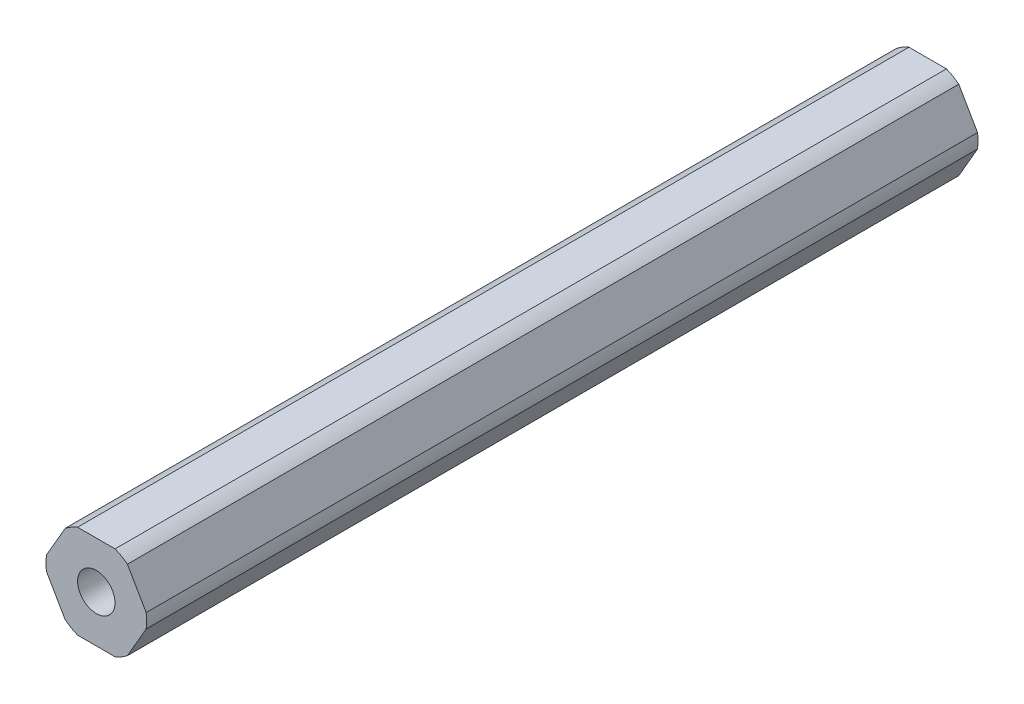
ISO-10303-21;
HEADER;
FILE_DESCRIPTION(('STEP AP214'),'2;1');
FILE_NAME('part.step','',(''),(''),'','','');
FILE_SCHEMA(('AUTOMOTIVE_DESIGN { 1 0 10303 214 1 1 1 1 }'));
ENDSEC;
DATA;
#1=APPLICATION_CONTEXT('core data for automotive mechanical design processes');
#2=APPLICATION_PROTOCOL_DEFINITION('international standard','automotive_design',2000,#1);
#3=PRODUCT_CONTEXT('',#1,'mechanical');
#4=PRODUCT('Part','Part','',(#3));
#5=PRODUCT_RELATED_PRODUCT_CATEGORY('part','',(#4));
#6=PRODUCT_DEFINITION_FORMATION('','',#4);
#7=PRODUCT_DEFINITION_CONTEXT('part definition',#1,'design');
#8=PRODUCT_DEFINITION('design','',#6,#7);
#9=PRODUCT_DEFINITION_SHAPE('','',#8);
#10=(LENGTH_UNIT() NAMED_UNIT(*) SI_UNIT(.MILLI.,.METRE.));
#11=(NAMED_UNIT(*) PLANE_ANGLE_UNIT() SI_UNIT($,.RADIAN.));
#12=(NAMED_UNIT(*) SI_UNIT($,.STERADIAN.) SOLID_ANGLE_UNIT());
#13=UNCERTAINTY_MEASURE_WITH_UNIT(LENGTH_MEASURE(1.E-05),#10,'distance_accuracy_value','');
#14=(GEOMETRIC_REPRESENTATION_CONTEXT(3) GLOBAL_UNCERTAINTY_ASSIGNED_CONTEXT((#13)) GLOBAL_UNIT_ASSIGNED_CONTEXT((#10,
#11,#12)) REPRESENTATION_CONTEXT('',''));
#15=CARTESIAN_POINT('',(0.,0.,0.));
#16=DIRECTION('',(0.,0.,1.));
#17=DIRECTION('',(1.,0.,0.));
#18=AXIS2_PLACEMENT_3D('',#15,#16,#17);
#19=CARTESIAN_POINT('',(3.68083890619154,-6.3754,228.6));
#20=DIRECTION('',(-0.866025403784439,0.5,0.));
#21=DIRECTION('',(0.,0.,1.));
#22=AXIS2_PLACEMENT_3D('',#19,#20,#21);
#23=PLANE('',#22);
#24=DIRECTION('',(0.,0.,-1.));
#25=VECTOR('',#24,1.);
#26=CARTESIAN_POINT('',(6.80102150534208,-0.971085209378962,-228.6));
#27=LINE('',#26,#25);
#28=CARTESIAN_POINT('',(6.80102150534206,-0.971085209378955,-131.445));
#29=VERTEX_POINT('',#28);
#30=CARTESIAN_POINT('',(6.80102150534208,-0.971085209378954,-244.853500116));
#31=VERTEX_POINT('',#30);
#32=EDGE_CURVE('E144',#29,#31,#27,.T.);
#33=ORIENTED_EDGE('',*,*,#32,.F.);
#34=DIRECTION('',(0.500000000000001,0.866025403784438,0.));
#35=VECTOR('',#34,1.);
#36=CARTESIAN_POINT('',(5.52125835928731,-3.1877,-131.445));
#37=LINE('',#36,#35);
#38=CARTESIAN_POINT('',(4.24149521323254,-5.40431479062105,-131.445));
#39=VERTEX_POINT('',#38);
#40=EDGE_CURVE('E147',#39,#29,#37,.T.);
#41=ORIENTED_EDGE('',*,*,#40,.F.);
#42=DIRECTION('',(0.,0.,1.));
#43=VECTOR('',#42,1.);
#44=CARTESIAN_POINT('',(4.24149521323255,-5.40431479062104,-228.6));
#45=LINE('',#44,#43);
#46=CARTESIAN_POINT('',(4.24149521323255,-5.40431479062105,-244.853500116));
#47=VERTEX_POINT('',#46);
#48=EDGE_CURVE('E242',#47,#39,#45,.T.);
#49=ORIENTED_EDGE('',*,*,#48,.F.);
#50=DIRECTION('',(0.5,0.866025403784439,0.));
#51=VECTOR('',#50,1.);
#52=CARTESIAN_POINT('',(6.80102150534208,-0.971085209378954,-244.853500116));
#53=LINE('',#52,#51);
#54=EDGE_CURVE('E149',#47,#31,#53,.T.);
#55=ORIENTED_EDGE('',*,*,#54,.T.);
#56=EDGE_LOOP('',(#33,#41,#49,#55));
#57=FACE_BOUND('',#56,.T.);
#58=ADVANCED_FACE('F39',(#57),#23,.F.);
#59=CARTESIAN_POINT('',(7.36167781238308,0.,228.6));
#60=DIRECTION('',(-0.866025403784439,-0.5,0.));
#61=DIRECTION('',(-0.5,0.866025403784439,0.));
#62=AXIS2_PLACEMENT_3D('',#59,#60,#61);
#63=PLANE('',#62);
#64=DIRECTION('',(0.,0.,-1.));
#65=VECTOR('',#64,1.);
#66=CARTESIAN_POINT('',(4.24149521323254,5.40431479062105,-228.6));
#67=LINE('',#66,#65);
#68=CARTESIAN_POINT('',(4.24149521323253,5.40431479062105,-131.445));
#69=VERTEX_POINT('',#68);
#70=CARTESIAN_POINT('',(4.24149521323254,5.40431479062105,-244.853500116));
#71=VERTEX_POINT('',#70);
#72=EDGE_CURVE('E239',#69,#71,#67,.T.);
#73=ORIENTED_EDGE('',*,*,#72,.F.);
#74=DIRECTION('',(-0.5,0.866025403784438,0.));
#75=VECTOR('',#74,1.);
#76=CARTESIAN_POINT('',(5.5212583592873,3.1877,-131.445));
#77=LINE('',#76,#75);
#78=CARTESIAN_POINT('',(6.80102150534208,0.971085209378976,-131.445));
#79=VERTEX_POINT('',#78);
#80=EDGE_CURVE('E161',#79,#69,#77,.T.);
#81=ORIENTED_EDGE('',*,*,#80,.F.);
#82=DIRECTION('',(0.,0.,1.));
#83=VECTOR('',#82,1.);
#84=CARTESIAN_POINT('',(6.80102150534208,0.971085209378949,-228.6));
#85=LINE('',#84,#83);
#86=CARTESIAN_POINT('',(6.80102150534208,0.97108520937895,-244.853500116));
#87=VERTEX_POINT('',#86);
#88=EDGE_CURVE('E153',#87,#79,#85,.T.);
#89=ORIENTED_EDGE('',*,*,#88,.F.);
#90=DIRECTION('',(-0.5,0.866025403784438,0.));
#91=VECTOR('',#90,1.);
#92=CARTESIAN_POINT('',(4.24149521323254,5.40431479062105,-244.853500116));
#93=LINE('',#92,#91);
#94=EDGE_CURVE('E201',#87,#71,#93,.T.);
#95=ORIENTED_EDGE('',*,*,#94,.T.);
#96=EDGE_LOOP('',(#73,#81,#89,#95));
#97=FACE_BOUND('',#96,.T.);
#98=ADVANCED_FACE('F286',(#97),#63,.F.);
#99=CARTESIAN_POINT('',(3.68083890619154,6.3754,228.6));
#100=DIRECTION('',(0.,-1.,0.));
#101=DIRECTION('',(0.,0.,-1.));
#102=AXIS2_PLACEMENT_3D('',#99,#100,#101);
#103=PLANE('',#102);
#104=DIRECTION('',(0.,0.,-1.));
#105=VECTOR('',#104,1.);
#106=CARTESIAN_POINT('',(-2.55952629210953,6.3754,-228.6));
#107=LINE('',#106,#105);
#108=CARTESIAN_POINT('',(-2.55952629210953,6.3754,-131.445));
#109=VERTEX_POINT('',#108);
#110=CARTESIAN_POINT('',(-2.55952629210953,6.3754,-244.853500116));
#111=VERTEX_POINT('',#110);
#112=EDGE_CURVE('E238',#109,#111,#107,.T.);
#113=ORIENTED_EDGE('',*,*,#112,.F.);
#114=DIRECTION('',(-1.,0.,0.));
#115=VECTOR('',#114,1.);
#116=CARTESIAN_POINT('',(0.,6.37540000000002,-131.445));
#117=LINE('',#116,#115);
#118=CARTESIAN_POINT('',(2.55952629210952,6.37540000000001,-131.445));
#119=VERTEX_POINT('',#118);
#120=EDGE_CURVE('E177',#119,#109,#117,.T.);
#121=ORIENTED_EDGE('',*,*,#120,.F.);
#122=DIRECTION('',(0.,0.,1.));
#123=VECTOR('',#122,1.);
#124=CARTESIAN_POINT('',(2.55952629210952,6.3754,-228.6));
#125=LINE('',#124,#123);
#126=CARTESIAN_POINT('',(2.55952629210953,6.3754,-244.853500116));
#127=VERTEX_POINT('',#126);
#128=EDGE_CURVE('E258',#127,#119,#125,.T.);
#129=ORIENTED_EDGE('',*,*,#128,.F.);
#130=DIRECTION('',(-1.,0.,0.));
#131=VECTOR('',#130,1.);
#132=CARTESIAN_POINT('',(-2.55952629210953,6.3754,-244.853500116));
#133=LINE('',#132,#131);
#134=EDGE_CURVE('E228',#127,#111,#133,.T.);
#135=ORIENTED_EDGE('',*,*,#134,.T.);
#136=EDGE_LOOP('',(#113,#121,#129,#135));
#137=FACE_BOUND('',#136,.T.);
#138=ADVANCED_FACE('F41',(#137),#103,.F.);
#139=CARTESIAN_POINT('',(-3.68083890619154,6.3754,228.6));
#140=DIRECTION('',(0.866025403784439,-0.5,0.));
#141=DIRECTION('',(0.,0.,-1.));
#142=AXIS2_PLACEMENT_3D('',#139,#140,#141);
#143=PLANE('',#142);
#144=DIRECTION('',(0.,0.,-1.));
#145=VECTOR('',#144,1.);
#146=CARTESIAN_POINT('',(-6.80102150534208,0.97108520937896,-228.6));
#147=LINE('',#146,#145);
#148=CARTESIAN_POINT('',(-6.80102150534208,0.971085209378983,-131.445));
#149=VERTEX_POINT('',#148);
#150=CARTESIAN_POINT('',(-6.80102150534208,0.971085209378961,-244.853500116));
#151=VERTEX_POINT('',#150);
#152=EDGE_CURVE('E243',#149,#151,#147,.T.);
#153=ORIENTED_EDGE('',*,*,#152,.F.);
#154=DIRECTION('',(-0.5,-0.866025403784438,0.));
#155=VECTOR('',#154,1.);
#156=CARTESIAN_POINT('',(-5.52125835928732,3.1877,-131.445));
#157=LINE('',#156,#155);
#158=CARTESIAN_POINT('',(-4.24149521323255,5.40431479062105,-131.445));
#159=VERTEX_POINT('',#158);
#160=EDGE_CURVE('E183',#159,#149,#157,.T.);
#161=ORIENTED_EDGE('',*,*,#160,.F.);
#162=DIRECTION('',(0.,0.,1.));
#163=VECTOR('',#162,1.);
#164=CARTESIAN_POINT('',(-4.24149521323255,5.40431479062105,-228.6));
#165=LINE('',#164,#163);
#166=CARTESIAN_POINT('',(-4.24149521323255,5.40431479062105,-244.853500116));
#167=VERTEX_POINT('',#166);
#168=EDGE_CURVE('E235',#167,#159,#165,.T.);
#169=ORIENTED_EDGE('',*,*,#168,.F.);
#170=DIRECTION('',(-0.5,-0.866025403784439,0.));
#171=VECTOR('',#170,1.);
#172=CARTESIAN_POINT('',(-6.80102150534208,0.971085209378961,-244.853500116));
#173=LINE('',#172,#171);
#174=EDGE_CURVE('E222',#167,#151,#173,.T.);
#175=ORIENTED_EDGE('',*,*,#174,.T.);
#176=EDGE_LOOP('',(#153,#161,#169,#175));
#177=FACE_BOUND('',#176,.T.);
#178=ADVANCED_FACE('F321',(#177),#143,.F.);
#179=CARTESIAN_POINT('',(-7.36167781238308,0.,228.6));
#180=DIRECTION('',(0.866025403784439,0.5,0.));
#181=DIRECTION('',(0.,0.,-1.));
#182=AXIS2_PLACEMENT_3D('',#179,#180,#181);
#183=PLANE('',#182);
#184=DIRECTION('',(0.,0.,-1.));
#185=VECTOR('',#184,1.);
#186=CARTESIAN_POINT('',(-4.24149521323255,-5.40431479062104,-228.6));
#187=LINE('',#186,#185);
#188=CARTESIAN_POINT('',(-4.24149521323255,-5.40431479062102,-131.445));
#189=VERTEX_POINT('',#188);
#190=CARTESIAN_POINT('',(-4.24149521323254,-5.40431479062105,-244.853500116));
#191=VERTEX_POINT('',#190);
#192=EDGE_CURVE('E252',#189,#191,#187,.T.);
#193=ORIENTED_EDGE('',*,*,#192,.F.);
#194=DIRECTION('',(0.5,-0.866025403784438,0.));
#195=VECTOR('',#194,1.);
#196=CARTESIAN_POINT('',(-5.52125835928731,-3.1877,-131.445));
#197=LINE('',#196,#195);
#198=CARTESIAN_POINT('',(-6.80102150534208,-0.971085209378948,-131.445));
#199=VERTEX_POINT('',#198);
#200=EDGE_CURVE('E189',#199,#189,#197,.T.);
#201=ORIENTED_EDGE('',*,*,#200,.F.);
#202=DIRECTION('',(0.,0.,1.));
#203=VECTOR('',#202,1.);
#204=CARTESIAN_POINT('',(-6.80102150534208,-0.971085209378962,-228.6));
#205=LINE('',#204,#203);
#206=CARTESIAN_POINT('',(-6.80102150534208,-0.971085209378957,-244.853500116));
#207=VERTEX_POINT('',#206);
#208=EDGE_CURVE('E246',#207,#199,#205,.T.);
#209=ORIENTED_EDGE('',*,*,#208,.F.);
#210=DIRECTION('',(0.500000000000001,-0.866025403784438,0.));
#211=VECTOR('',#210,1.);
#212=CARTESIAN_POINT('',(-4.24149521323254,-5.40431479062105,-244.853500116));
#213=LINE('',#212,#211);
#214=EDGE_CURVE('E216',#207,#191,#213,.T.);
#215=ORIENTED_EDGE('',*,*,#214,.T.);
#216=EDGE_LOOP('',(#193,#201,#209,#215));
#217=FACE_BOUND('',#216,.T.);
#218=ADVANCED_FACE('F280',(#217),#183,.F.);
#219=CARTESIAN_POINT('',(-3.68083890619154,-6.3754,228.6));
#220=DIRECTION('',(0.,1.,0.));
#221=DIRECTION('',(1.,0.,0.));
#222=AXIS2_PLACEMENT_3D('',#219,#220,#221);
#223=PLANE('',#222);
#224=DIRECTION('',(0.,0.,-1.));
#225=VECTOR('',#224,1.);
#226=CARTESIAN_POINT('',(2.55952629210953,-6.3754,-228.6));
#227=LINE('',#226,#225);
#228=CARTESIAN_POINT('',(2.55952629210952,-6.3754,-131.445));
#229=VERTEX_POINT('',#228);
#230=CARTESIAN_POINT('',(2.55952629210953,-6.3754,-244.853500116));
#231=VERTEX_POINT('',#230);
#232=EDGE_CURVE('E249',#229,#231,#227,.T.);
#233=ORIENTED_EDGE('',*,*,#232,.F.);
#234=DIRECTION('',(1.,0.,0.));
#235=VECTOR('',#234,1.);
#236=CARTESIAN_POINT('',(0.,-6.3754,-131.445));
#237=LINE('',#236,#235);
#238=CARTESIAN_POINT('',(-2.55952629210953,-6.3754,-131.445));
#239=VERTEX_POINT('',#238);
#240=EDGE_CURVE('E195',#239,#229,#237,.T.);
#241=ORIENTED_EDGE('',*,*,#240,.F.);
#242=DIRECTION('',(0.,0.,1.));
#243=VECTOR('',#242,1.);
#244=CARTESIAN_POINT('',(-2.55952629210953,-6.3754,-228.6));
#245=LINE('',#244,#243);
#246=CARTESIAN_POINT('',(-2.55952629210953,-6.3754,-244.853500116));
#247=VERTEX_POINT('',#246);
#248=EDGE_CURVE('E245',#247,#239,#245,.T.);
#249=ORIENTED_EDGE('',*,*,#248,.F.);
#250=DIRECTION('',(1.,0.,0.));
#251=VECTOR('',#250,1.);
#252=CARTESIAN_POINT('',(2.55952629210953,-6.3754,-244.853500116));
#253=LINE('',#252,#251);
#254=EDGE_CURVE('E210',#247,#231,#253,.T.);
#255=ORIENTED_EDGE('',*,*,#254,.T.);
#256=EDGE_LOOP('',(#233,#241,#249,#255));
#257=FACE_BOUND('',#256,.T.);
#258=ADVANCED_FACE('F271',(#257),#223,.F.);
#259=CARTESIAN_POINT('',(0.,0.,-228.6));
#260=DIRECTION('',(0.,0.,1.));
#261=DIRECTION('',(1.,0.,0.));
#262=AXIS2_PLACEMENT_3D('',#259,#260,#261);
#263=CYLINDRICAL_SURFACE('',#262,6.87);
#264=DIRECTION('',(0.,0.,1.));
#265=VECTOR('',#264,1.);
#266=CARTESIAN_POINT('',(6.87,0.,-228.6));
#267=LINE('',#266,#265);
#268=CARTESIAN_POINT('',(6.87,0.,-228.6));
#269=VERTEX_POINT('',#268);
#270=CARTESIAN_POINT('',(6.87,0.,-154.94));
#271=VERTEX_POINT('',#270);
#272=EDGE_CURVE('E49',#269,#271,#267,.T.);
#273=ORIENTED_EDGE('',*,*,#272,.T.);
#274=ORIENTED_EDGE('',*,*,#272,.F.);
#275=EDGE_LOOP('',(#273,#274));
#276=FACE_BOUND('',#275,.T.);
#277=ORIENTED_EDGE('',*,*,#88,.T.);
#278=CARTESIAN_POINT('',(0.,0.,-131.445));
#279=DIRECTION('',(0.,0.,1.));
#280=DIRECTION('',(1.,0.,0.));
#281=AXIS2_PLACEMENT_3D('',#278,#279,#280);
#282=CIRCLE('',#281,6.87);
#283=EDGE_CURVE('E156',#29,#79,#282,.T.);
#284=ORIENTED_EDGE('',*,*,#283,.F.);
#285=ORIENTED_EDGE('',*,*,#32,.T.);
#286=CARTESIAN_POINT('',(0.,0.,-244.853500116));
#287=DIRECTION('',(0.,0.,1.));
#288=DIRECTION('',(1.,0.,0.));
#289=AXIS2_PLACEMENT_3D('',#286,#287,#288);
#290=CIRCLE('',#289,6.87);
#291=EDGE_CURVE('E204',#31,#87,#290,.T.);
#292=ORIENTED_EDGE('',*,*,#291,.T.);
#293=EDGE_LOOP('',(#277,#284,#285,#292));
#294=FACE_BOUND('',#293,.T.);
#295=ADVANCED_FACE('F157',(#276,#294),#263,.T.);
#296=CARTESIAN_POINT('',(0.,0.,-228.6));
#297=DIRECTION('',(0.,0.,1.));
#298=DIRECTION('',(1.,0.,0.));
#299=AXIS2_PLACEMENT_3D('',#296,#297,#298);
#300=CYLINDRICAL_SURFACE('',#299,6.87);
#301=ORIENTED_EDGE('',*,*,#48,.T.);
#302=CARTESIAN_POINT('',(0.,0.,-131.445));
#303=DIRECTION('',(0.,0.,1.));
#304=DIRECTION('',(1.,0.,0.));
#305=AXIS2_PLACEMENT_3D('',#302,#303,#304);
#306=CIRCLE('',#305,6.87);
#307=EDGE_CURVE('E167',#229,#39,#306,.T.);
#308=ORIENTED_EDGE('',*,*,#307,.F.);
#309=ORIENTED_EDGE('',*,*,#232,.T.);
#310=CARTESIAN_POINT('',(0.,0.,-244.853500116));
#311=DIRECTION('',(0.,0.,1.));
#312=DIRECTION('',(1.,0.,0.));
#313=AXIS2_PLACEMENT_3D('',#310,#311,#312);
#314=CIRCLE('',#313,6.87);
#315=EDGE_CURVE('E207',#231,#47,#314,.T.);
#316=ORIENTED_EDGE('',*,*,#315,.T.);
#317=EDGE_LOOP('',(#301,#308,#309,#316));
#318=FACE_BOUND('',#317,.T.);
#319=ADVANCED_FACE('F270',(#318),#300,.T.);
#320=CARTESIAN_POINT('',(0.,0.,-228.6));
#321=DIRECTION('',(0.,0.,1.));
#322=DIRECTION('',(1.,0.,0.));
#323=AXIS2_PLACEMENT_3D('',#320,#321,#322);
#324=CYLINDRICAL_SURFACE('',#323,6.87);
#325=ORIENTED_EDGE('',*,*,#248,.T.);
#326=CARTESIAN_POINT('',(0.,0.,-131.445));
#327=DIRECTION('',(0.,0.,1.));
#328=DIRECTION('',(1.,0.,0.));
#329=AXIS2_PLACEMENT_3D('',#326,#327,#328);
#330=CIRCLE('',#329,6.87);
#331=EDGE_CURVE('E192',#189,#239,#330,.T.);
#332=ORIENTED_EDGE('',*,*,#331,.F.);
#333=ORIENTED_EDGE('',*,*,#192,.T.);
#334=CARTESIAN_POINT('',(0.,0.,-244.853500116));
#335=DIRECTION('',(0.,0.,1.));
#336=DIRECTION('',(1.,0.,0.));
#337=AXIS2_PLACEMENT_3D('',#334,#335,#336);
#338=CIRCLE('',#337,6.87);
#339=EDGE_CURVE('E213',#191,#247,#338,.T.);
#340=ORIENTED_EDGE('',*,*,#339,.T.);
#341=EDGE_LOOP('',(#325,#332,#333,#340));
#342=FACE_BOUND('',#341,.T.);
#343=ADVANCED_FACE('F277',(#342),#324,.T.);
#344=CARTESIAN_POINT('',(0.,0.,-228.6));
#345=DIRECTION('',(0.,0.,1.));
#346=DIRECTION('',(1.,0.,0.));
#347=AXIS2_PLACEMENT_3D('',#344,#345,#346);
#348=CYLINDRICAL_SURFACE('',#347,6.87);
#349=ORIENTED_EDGE('',*,*,#208,.T.);
#350=CARTESIAN_POINT('',(0.,0.,-131.445));
#351=DIRECTION('',(0.,0.,1.));
#352=DIRECTION('',(1.,0.,0.));
#353=AXIS2_PLACEMENT_3D('',#350,#351,#352);
#354=CIRCLE('',#353,6.87);
#355=EDGE_CURVE('E186',#149,#199,#354,.T.);
#356=ORIENTED_EDGE('',*,*,#355,.F.);
#357=ORIENTED_EDGE('',*,*,#152,.T.);
#358=CARTESIAN_POINT('',(0.,0.,-244.853500116));
#359=DIRECTION('',(0.,0.,1.));
#360=DIRECTION('',(1.,0.,0.));
#361=AXIS2_PLACEMENT_3D('',#358,#359,#360);
#362=CIRCLE('',#361,6.87);
#363=EDGE_CURVE('E219',#151,#207,#362,.T.);
#364=ORIENTED_EDGE('',*,*,#363,.T.);
#365=EDGE_LOOP('',(#349,#356,#357,#364));
#366=FACE_BOUND('',#365,.T.);
#367=ADVANCED_FACE('F298',(#366),#348,.T.);
#368=CARTESIAN_POINT('',(0.,0.,-228.6));
#369=DIRECTION('',(0.,0.,1.));
#370=DIRECTION('',(1.,0.,0.));
#371=AXIS2_PLACEMENT_3D('',#368,#369,#370);
#372=CYLINDRICAL_SURFACE('',#371,6.87);
#373=ORIENTED_EDGE('',*,*,#168,.T.);
#374=CARTESIAN_POINT('',(0.,0.,-131.445));
#375=DIRECTION('',(0.,0.,1.));
#376=DIRECTION('',(1.,0.,0.));
#377=AXIS2_PLACEMENT_3D('',#374,#375,#376);
#378=CIRCLE('',#377,6.87);
#379=EDGE_CURVE('E180',#109,#159,#378,.T.);
#380=ORIENTED_EDGE('',*,*,#379,.F.);
#381=ORIENTED_EDGE('',*,*,#112,.T.);
#382=CARTESIAN_POINT('',(0.,0.,-244.853500116));
#383=DIRECTION('',(0.,0.,1.));
#384=DIRECTION('',(1.,0.,0.));
#385=AXIS2_PLACEMENT_3D('',#382,#383,#384);
#386=CIRCLE('',#385,6.87);
#387=EDGE_CURVE('E225',#111,#167,#386,.T.);
#388=ORIENTED_EDGE('',*,*,#387,.T.);
#389=EDGE_LOOP('',(#373,#380,#381,#388));
#390=FACE_BOUND('',#389,.T.);
#391=ADVANCED_FACE('F295',(#390),#372,.T.);
#392=CARTESIAN_POINT('',(0.,0.,-228.6));
#393=DIRECTION('',(0.,0.,1.));
#394=DIRECTION('',(1.,0.,0.));
#395=AXIS2_PLACEMENT_3D('',#392,#393,#394);
#396=CYLINDRICAL_SURFACE('',#395,6.87);
#397=ORIENTED_EDGE('',*,*,#128,.T.);
#398=CARTESIAN_POINT('',(0.,0.,-131.445));
#399=DIRECTION('',(0.,0.,1.));
#400=DIRECTION('',(1.,0.,0.));
#401=AXIS2_PLACEMENT_3D('',#398,#399,#400);
#402=CIRCLE('',#401,6.87);
#403=EDGE_CURVE('E174',#69,#119,#402,.T.);
#404=ORIENTED_EDGE('',*,*,#403,.F.);
#405=ORIENTED_EDGE('',*,*,#72,.T.);
#406=CARTESIAN_POINT('',(0.,0.,-244.853500116));
#407=DIRECTION('',(0.,0.,1.));
#408=DIRECTION('',(1.,0.,0.));
#409=AXIS2_PLACEMENT_3D('',#406,#407,#408);
#410=CIRCLE('',#409,6.87);
#411=EDGE_CURVE('E198',#71,#127,#410,.T.);
#412=ORIENTED_EDGE('',*,*,#411,.T.);
#413=EDGE_LOOP('',(#397,#404,#405,#412));
#414=FACE_BOUND('',#413,.T.);
#415=ADVANCED_FACE('F297',(#414),#396,.T.);
#416=CARTESIAN_POINT('',(0.,0.,-228.6));
#417=DIRECTION('',(0.,0.,1.));
#418=DIRECTION('',(1.,0.,0.));
#419=AXIS2_PLACEMENT_3D('',#416,#417,#418);
#420=CYLINDRICAL_SURFACE('',#419,2.55);
#421=DIRECTION('',(0.,0.,1.));
#422=VECTOR('',#421,1.);
#423=CARTESIAN_POINT('',(-2.55,0.,-228.6));
#424=LINE('',#423,#422);
#425=CARTESIAN_POINT('',(-2.55,0.,-228.6));
#426=VERTEX_POINT('',#425);
#427=CARTESIAN_POINT('',(-2.55,0.,-154.94));
#428=VERTEX_POINT('',#427);
#429=EDGE_CURVE('E11',#426,#428,#424,.T.);
#430=ORIENTED_EDGE('',*,*,#429,.T.);
#431=ORIENTED_EDGE('',*,*,#429,.F.);
#432=EDGE_LOOP('',(#430,#431));
#433=FACE_BOUND('',#432,.T.);
#434=DIRECTION('',(0.,0.,1.));
#435=VECTOR('',#434,1.);
#436=CARTESIAN_POINT('',(2.55,0.,-228.6));
#437=LINE('',#436,#435);
#438=CARTESIAN_POINT('',(2.55,0.,-228.6));
#439=VERTEX_POINT('',#438);
#440=CARTESIAN_POINT('',(2.55,0.,-154.94));
#441=VERTEX_POINT('',#440);
#442=EDGE_CURVE('E234',#439,#441,#437,.T.);
#443=ORIENTED_EDGE('',*,*,#442,.T.);
#444=ORIENTED_EDGE('',*,*,#442,.F.);
#445=EDGE_LOOP('',(#443,#444));
#446=FACE_BOUND('',#445,.T.);
#447=CARTESIAN_POINT('',(0.,0.,-244.853500116));
#448=DIRECTION('',(0.,0.,1.));
#449=DIRECTION('',(1.,0.,0.));
#450=AXIS2_PLACEMENT_3D('',#447,#448,#449);
#451=CIRCLE('',#450,2.55);
#452=CARTESIAN_POINT('',(2.55,0.,-244.853500116));
#453=VERTEX_POINT('',#452);
#454=EDGE_CURVE('E231',#453,#453,#451,.T.);
#455=ORIENTED_EDGE('',*,*,#454,.F.);
#456=EDGE_LOOP('',(#455));
#457=FACE_BOUND('',#456,.T.);
#458=CARTESIAN_POINT('',(0.,0.,-131.445));
#459=DIRECTION('',(0.,0.,1.));
#460=DIRECTION('',(1.,0.,0.));
#461=AXIS2_PLACEMENT_3D('',#458,#459,#460);
#462=CIRCLE('',#461,2.55);
#463=CARTESIAN_POINT('',(2.55,0.,-131.445));
#464=VERTEX_POINT('',#463);
#465=EDGE_CURVE('E168',#464,#464,#462,.F.);
#466=ORIENTED_EDGE('',*,*,#465,.F.);
#467=EDGE_LOOP('',(#466));
#468=FACE_BOUND('',#467,.T.);
#469=ADVANCED_FACE('F300',(#433,#446,#457,#468),#420,.F.);
#470=CARTESIAN_POINT('',(7.37809510475938,-8.14137961878532,-244.853500116));
#471=DIRECTION('',(0.,0.,1.));
#472=DIRECTION('',(1.,0.,0.));
#473=AXIS2_PLACEMENT_3D('',#470,#471,#472);
#474=PLANE('',#473);
#475=ORIENTED_EDGE('',*,*,#454,.T.);
#476=EDGE_LOOP('',(#475));
#477=FACE_BOUND('',#476,.T.);
#478=ORIENTED_EDGE('',*,*,#94,.F.);
#479=ORIENTED_EDGE('',*,*,#291,.F.);
#480=ORIENTED_EDGE('',*,*,#54,.F.);
#481=ORIENTED_EDGE('',*,*,#315,.F.);
#482=ORIENTED_EDGE('',*,*,#254,.F.);
#483=ORIENTED_EDGE('',*,*,#339,.F.);
#484=ORIENTED_EDGE('',*,*,#214,.F.);
#485=ORIENTED_EDGE('',*,*,#363,.F.);
#486=ORIENTED_EDGE('',*,*,#174,.F.);
#487=ORIENTED_EDGE('',*,*,#387,.F.);
#488=ORIENTED_EDGE('',*,*,#134,.F.);
#489=ORIENTED_EDGE('',*,*,#411,.F.);
#490=EDGE_LOOP('',(#478,#479,#480,#481,#482,#483,#484,#485,#486,#487,#488,#489));
#491=FACE_BOUND('',#490,.T.);
#492=ADVANCED_FACE('F302',(#477,#491),#474,.F.);
#493=CARTESIAN_POINT('',(0.,0.,-131.445));
#494=DIRECTION('',(0.,0.,1.));
#495=DIRECTION('',(1.,0.,0.));
#496=AXIS2_PLACEMENT_3D('',#493,#494,#495);
#497=PLANE('',#496);
#498=ORIENTED_EDGE('',*,*,#465,.T.);
#499=EDGE_LOOP('',(#498));
#500=FACE_BOUND('',#499,.T.);
#501=ORIENTED_EDGE('',*,*,#40,.T.);
#502=ORIENTED_EDGE('',*,*,#283,.T.);
#503=ORIENTED_EDGE('',*,*,#80,.T.);
#504=ORIENTED_EDGE('',*,*,#403,.T.);
#505=ORIENTED_EDGE('',*,*,#120,.T.);
#506=ORIENTED_EDGE('',*,*,#379,.T.);
#507=ORIENTED_EDGE('',*,*,#160,.T.);
#508=ORIENTED_EDGE('',*,*,#355,.T.);
#509=ORIENTED_EDGE('',*,*,#200,.T.);
#510=ORIENTED_EDGE('',*,*,#331,.T.);
#511=ORIENTED_EDGE('',*,*,#240,.T.);
#512=ORIENTED_EDGE('',*,*,#307,.T.);
#513=EDGE_LOOP('',(#501,#502,#503,#504,#505,#506,#507,#508,#509,#510,#511,#512));
#514=FACE_BOUND('',#513,.T.);
#515=ADVANCED_FACE('F164',(#500,#514),#497,.T.);
#516=CLOSED_SHELL('',(#58,#98,#138,#178,#218,#258,#295,#319,#343,#367,#391,#415,#469,#492,#515));
#517=MANIFOLD_SOLID_BREP('B2',#516);
#518=ADVANCED_BREP_SHAPE_REPRESENTATION('',(#18,#517),#14);
#519=SHAPE_DEFINITION_REPRESENTATION(#9,#518);
ENDSEC;
END-ISO-10303-21;
